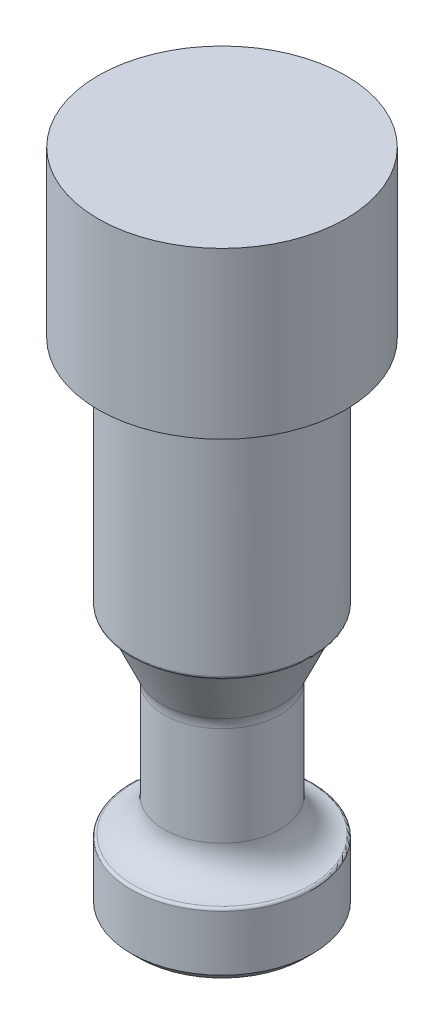
ISO-10303-21;
HEADER;
FILE_DESCRIPTION(('STEP AP214'),'2;1');
FILE_NAME('part.step','',(''),(''),'','','');
FILE_SCHEMA(('AUTOMOTIVE_DESIGN { 1 0 10303 214 1 1 1 1 }'));
ENDSEC;
DATA;
#1=APPLICATION_CONTEXT('core data for automotive mechanical design processes');
#2=APPLICATION_PROTOCOL_DEFINITION('international standard','automotive_design',2000,#1);
#3=PRODUCT_CONTEXT('',#1,'mechanical');
#4=PRODUCT('Part','Part','',(#3));
#5=PRODUCT_RELATED_PRODUCT_CATEGORY('part','',(#4));
#6=PRODUCT_DEFINITION_FORMATION('','',#4);
#7=PRODUCT_DEFINITION_CONTEXT('part definition',#1,'design');
#8=PRODUCT_DEFINITION('design','',#6,#7);
#9=PRODUCT_DEFINITION_SHAPE('','',#8);
#10=(LENGTH_UNIT() NAMED_UNIT(*) SI_UNIT(.MILLI.,.METRE.));
#11=(NAMED_UNIT(*) PLANE_ANGLE_UNIT() SI_UNIT($,.RADIAN.));
#12=(NAMED_UNIT(*) SI_UNIT($,.STERADIAN.) SOLID_ANGLE_UNIT());
#13=UNCERTAINTY_MEASURE_WITH_UNIT(LENGTH_MEASURE(1.E-05),#10,'distance_accuracy_value','');
#14=(GEOMETRIC_REPRESENTATION_CONTEXT(3) GLOBAL_UNCERTAINTY_ASSIGNED_CONTEXT((#13)) GLOBAL_UNIT_ASSIGNED_CONTEXT((#10,
#11,#12)) REPRESENTATION_CONTEXT('',''));
#15=CARTESIAN_POINT('',(0.,0.,0.));
#16=DIRECTION('',(0.,0.,1.));
#17=DIRECTION('',(1.,0.,0.));
#18=AXIS2_PLACEMENT_3D('',#15,#16,#17);
#19=CARTESIAN_POINT('',(0.,47.625,0.));
#20=DIRECTION('',(0.,-1.,0.));
#21=DIRECTION('',(0.,0.,-1.));
#22=AXIS2_PLACEMENT_3D('',#19,#20,#21);
#23=CYLINDRICAL_SURFACE('',#22,8.73125);
#24=CARTESIAN_POINT('',(0.,6.10542113853439,0.));
#25=DIRECTION('',(0.,-1.,0.));
#26=DIRECTION('',(0.,0.,-1.));
#27=AXIS2_PLACEMENT_3D('',#24,#25,#26);
#28=CIRCLE('',#27,8.73125);
#29=CARTESIAN_POINT('',(0.,6.10542113853439,-8.73125));
#30=VERTEX_POINT('',#29);
#31=EDGE_CURVE('E10',#30,#30,#28,.T.);
#32=ORIENTED_EDGE('',*,*,#31,.T.);
#33=EDGE_LOOP('',(#32));
#34=FACE_BOUND('',#33,.T.);
#35=CARTESIAN_POINT('',(0.,0.793750000000003,0.));
#36=DIRECTION('',(0.,1.,0.));
#37=DIRECTION('',(0.,0.,1.));
#38=AXIS2_PLACEMENT_3D('',#35,#36,#37);
#39=CIRCLE('',#38,8.73125);
#40=CARTESIAN_POINT('',(0.,0.793750000000003,8.73125));
#41=VERTEX_POINT('',#40);
#42=EDGE_CURVE('E68',#41,#41,#39,.T.);
#43=ORIENTED_EDGE('',*,*,#42,.T.);
#44=EDGE_LOOP('',(#43));
#45=FACE_BOUND('',#44,.T.);
#46=ADVANCED_FACE('F37',(#34,#45),#23,.T.);
#47=CARTESIAN_POINT('',(0.,0.,0.));
#48=DIRECTION('',(0.,1.,0.));
#49=DIRECTION('',(0.,0.,1.));
#50=AXIS2_PLACEMENT_3D('',#47,#48,#49);
#51=PLANE('',#50);
#52=CARTESIAN_POINT('',(0.,0.,0.));
#53=DIRECTION('',(0.,1.,0.));
#54=DIRECTION('',(0.,0.,1.));
#55=AXIS2_PLACEMENT_3D('',#52,#53,#54);
#56=CIRCLE('',#55,7.9375);
#57=CARTESIAN_POINT('',(0.,0.,7.9375));
#58=VERTEX_POINT('',#57);
#59=EDGE_CURVE('E64',#58,#58,#56,.F.);
#60=ORIENTED_EDGE('',*,*,#59,.T.);
#61=EDGE_LOOP('',(#60));
#62=FACE_BOUND('',#61,.T.);
#63=ADVANCED_FACE('F115',(#62),#51,.F.);
#64=CARTESIAN_POINT('',(0.,0.793750000000003,0.));
#65=DIRECTION('',(0.,1.,0.));
#66=DIRECTION('',(0.,0.,1.));
#67=AXIS2_PLACEMENT_3D('',#64,#65,#66);
#68=CONICAL_SURFACE('',#67,8.73125,0.785398163397448);
#69=CARTESIAN_POINT('',(0.,0.,7.9375));
#70=CARTESIAN_POINT('',(0.,0.008268229166667,7.94576822916666));
#71=CARTESIAN_POINT('',(0.,0.0165364583333336,7.95403645833333));
#72=CARTESIAN_POINT('',(0.,0.0330729166666667,7.97057291666666));
#73=CARTESIAN_POINT('',(0.,0.0413411458333333,7.97884114583333));
#74=CARTESIAN_POINT('',(0.,0.0578776041666666,7.99537760416666));
#75=CARTESIAN_POINT('',(0.,0.0661458333333334,8.00364583333333));
#76=CARTESIAN_POINT('',(0.,0.0826822916666669,8.02018229166666));
#77=CARTESIAN_POINT('',(0.,0.0909505208333338,8.02845052083333));
#78=CARTESIAN_POINT('',(0.,0.107486979166667,8.04498697916666));
#79=CARTESIAN_POINT('',(0.,0.115755208333333,8.05325520833333));
#80=CARTESIAN_POINT('',(0.,0.132291666666667,8.06979166666666));
#81=CARTESIAN_POINT('',(0.,0.140559895833334,8.07805989583333));
#82=CARTESIAN_POINT('',(0.,0.157096354166667,8.09459635416666));
#83=CARTESIAN_POINT('',(0.,0.165364583333334,8.10286458333333));
#84=CARTESIAN_POINT('',(0.,0.181901041666667,8.11940104166666));
#85=CARTESIAN_POINT('',(0.,0.190169270833334,8.12766927083333));
#86=CARTESIAN_POINT('',(0.,0.206705729166667,8.14420572916666));
#87=CARTESIAN_POINT('',(0.,0.214973958333334,8.15247395833333));
#88=CARTESIAN_POINT('',(0.,0.231510416666667,8.16901041666666));
#89=CARTESIAN_POINT('',(0.,0.239778645833334,8.17727864583333));
#90=CARTESIAN_POINT('',(0.,0.256315104166667,8.19381510416667));
#91=CARTESIAN_POINT('',(0.,0.264583333333334,8.20208333333333));
#92=CARTESIAN_POINT('',(0.,0.281119791666668,8.21861979166667));
#93=CARTESIAN_POINT('',(0.,0.289388020833335,8.22688802083333));
#94=CARTESIAN_POINT('',(0.,0.305924479166668,8.24342447916666));
#95=CARTESIAN_POINT('',(0.,0.314192708333334,8.25169270833333));
#96=CARTESIAN_POINT('',(0.,0.330729166666668,8.26822916666666));
#97=CARTESIAN_POINT('',(0.,0.338997395833335,8.27649739583333));
#98=CARTESIAN_POINT('',(0.,0.355533854166668,8.29303385416666));
#99=CARTESIAN_POINT('',(0.,0.363802083333334,8.30130208333333));
#100=CARTESIAN_POINT('',(0.,0.380338541666668,8.31783854166667));
#101=CARTESIAN_POINT('',(0.,0.388606770833335,8.32610677083333));
#102=CARTESIAN_POINT('',(0.,0.405143229166668,8.34264322916667));
#103=CARTESIAN_POINT('',(0.,0.413411458333335,8.35091145833333));
#104=CARTESIAN_POINT('',(0.,0.429947916666668,8.36744791666666));
#105=CARTESIAN_POINT('',(0.,0.438216145833335,8.37571614583333));
#106=CARTESIAN_POINT('',(0.,0.454752604166668,8.39225260416667));
#107=CARTESIAN_POINT('',(0.,0.463020833333335,8.40052083333333));
#108=CARTESIAN_POINT('',(0.,0.479557291666668,8.41705729166667));
#109=CARTESIAN_POINT('',(0.,0.487825520833335,8.42532552083333));
#110=CARTESIAN_POINT('',(0.,0.504361979166668,8.44186197916667));
#111=CARTESIAN_POINT('',(0.,0.512630208333335,8.45013020833333));
#112=CARTESIAN_POINT('',(0.,0.529166666666668,8.46666666666667));
#113=CARTESIAN_POINT('',(0.,0.537434895833335,8.47493489583333));
#114=CARTESIAN_POINT('',(0.,0.553971354166669,8.49147135416666));
#115=CARTESIAN_POINT('',(0.,0.562239583333335,8.49973958333333));
#116=CARTESIAN_POINT('',(0.,0.578776041666668,8.51627604166667));
#117=CARTESIAN_POINT('',(0.,0.587044270833335,8.52454427083333));
#118=CARTESIAN_POINT('',(0.,0.603580729166669,8.54108072916667));
#119=CARTESIAN_POINT('',(0.,0.611848958333336,8.54934895833333));
#120=CARTESIAN_POINT('',(0.,0.628385416666669,8.56588541666667));
#121=CARTESIAN_POINT('',(0.,0.636653645833335,8.57415364583333));
#122=CARTESIAN_POINT('',(0.,0.653190104166669,8.59069010416667));
#123=CARTESIAN_POINT('',(0.,0.661458333333335,8.59895833333333));
#124=CARTESIAN_POINT('',(0.,0.677994791666669,8.61549479166667));
#125=CARTESIAN_POINT('',(0.,0.686263020833336,8.62376302083333));
#126=CARTESIAN_POINT('',(0.,0.702799479166669,8.64029947916667));
#127=CARTESIAN_POINT('',(0.,0.711067708333336,8.64856770833333));
#128=CARTESIAN_POINT('',(0.,0.727604166666669,8.66510416666667));
#129=CARTESIAN_POINT('',(0.,0.735872395833336,8.67337239583333));
#130=CARTESIAN_POINT('',(0.,0.752408854166669,8.68990885416667));
#131=CARTESIAN_POINT('',(0.,0.760677083333336,8.69817708333333));
#132=CARTESIAN_POINT('',(0.,0.777213541666669,8.71471354166667));
#133=CARTESIAN_POINT('',(0.,0.785481770833336,8.72298177083333));
#134=CARTESIAN_POINT('',(0.,0.793750000000003,8.73125));
#135=B_SPLINE_CURVE_WITH_KNOTS('',3,(#69,#70,#71,#72,#73,#74,#75,#76,#77,#78,#79,#80,#81,#82,
#83,#84,#85,#86,#87,#88,#89,#90,#91,#92,#93,#94,#95,#96,#97,#98,#99,#100,#101,#102,#103,#104,
#105,#106,#107,#108,#109,#110,#111,#112,#113,#114,#115,#116,#117,#118,#119,#120,#121,#122,#123,
#124,#125,#126,#127,#128,#129,#130,#131,#132,#133,#134),.UNSPECIFIED.,.F.,.F.,(4,2,2,2,2,2,2,2,
2,2,2,2,2,2,2,2,2,2,2,2,2,2,2,2,2,2,2,2,2,2,2,2,4),(0.,0.035079125472926,0.0701582509458533,
0.105237376418779,0.140316501891705,0.175395627364633,0.210474752837559,0.245553878310486,
0.280633003783412,0.315712129256338,0.350791254729265,0.385870380202191,0.420949505675118,
0.456028631148045,0.491107756620971,0.526186882093898,0.561266007566824,0.59634513303975,
0.631424258512677,0.666503383985603,0.70158250945853,0.736661634931457,0.771740760404383,
0.80681988587731,0.841899011350236,0.876978136823162,0.912057262296089,0.947136387769015,
0.982215513241941,1.01729463871487,1.05237376418779,1.08745288966072,1.12253201513365),.UNSPECIFIED.);
#136=EDGE_CURVE('BSEAM121',#58,#41,#135,.T.);
#137=ORIENTED_EDGE('',*,*,#59,.F.);
#138=ORIENTED_EDGE('',*,*,#42,.F.);
#139=ORIENTED_EDGE('',*,*,#136,.T.);
#140=ORIENTED_EDGE('',*,*,#136,.F.);
#141=EDGE_LOOP('',(#137,#139,#138,#140));
#142=FACE_BOUND('',#141,.T.);
#143=ADVANCED_FACE('F121',(#142),#68,.T.);
#144=CARTESIAN_POINT('',(0.,24.6062507910648,0.));
#145=DIRECTION('',(0.,1.,0.));
#146=DIRECTION('',(0.,0.,1.));
#147=AXIS2_PLACEMENT_3D('',#144,#145,#146);
#148=TOROIDAL_SURFACE('',#147,8.73125,0.793750000000003);
#149=CARTESIAN_POINT('',(0.,25.3763234976499,0.));
#150=DIRECTION('',(0.,-1.,0.));
#151=DIRECTION('',(0.,0.,-1.));
#152=AXIS2_PLACEMENT_3D('',#149,#150,#151);
#153=CIRCLE('',#152,8.53882575757578);
#154=CARTESIAN_POINT('',(0.,25.3763234976499,-8.53882575757578));
#155=VERTEX_POINT('',#154);
#156=EDGE_CURVE('E52',#155,#155,#153,.T.);
#157=ORIENTED_EDGE('',*,*,#156,.T.);
#158=EDGE_LOOP('',(#157));
#159=FACE_BOUND('',#158,.T.);
#160=CARTESIAN_POINT('',(0.,24.9361702795469,0.));
#161=DIRECTION('',(0.,1.,0.));
#162=DIRECTION('',(0.,0.,1.));
#163=AXIS2_PLACEMENT_3D('',#160,#161,#162);
#164=CIRCLE('',#163,8.0093135806252);
#165=CARTESIAN_POINT('',(0.,24.9361702795469,8.0093135806252));
#166=VERTEX_POINT('',#165);
#167=EDGE_CURVE('E85',#166,#166,#164,.T.);
#168=ORIENTED_EDGE('',*,*,#167,.T.);
#169=EDGE_LOOP('',(#168));
#170=FACE_BOUND('',#169,.T.);
#171=ADVANCED_FACE('F153',(#159,#170),#148,.F.);
#172=CARTESIAN_POINT('',(0.,20.0397592565111,0.));
#173=DIRECTION('',(0.,1.,0.));
#174=DIRECTION('',(0.,0.,1.));
#175=AXIS2_PLACEMENT_3D('',#172,#173,#174);
#176=CONICAL_SURFACE('',#175,5.77169074187561,0.428653606815713);
#177=ORIENTED_EDGE('',*,*,#167,.F.);
#178=EDGE_LOOP('',(#177));
#179=FACE_BOUND('',#178,.T.);
#180=CARTESIAN_POINT('',(0.,20.0397592565111,0.));
#181=DIRECTION('',(0.,1.,0.));
#182=DIRECTION('',(0.,0.,1.));
#183=AXIS2_PLACEMENT_3D('',#180,#181,#182);
#184=CIRCLE('',#183,5.77169074187561);
#185=CARTESIAN_POINT('',(0.,20.0397592565111,5.77169074187561));
#186=VERTEX_POINT('',#185);
#187=EDGE_CURVE('E82',#186,#186,#184,.T.);
#188=ORIENTED_EDGE('',*,*,#187,.T.);
#189=EDGE_LOOP('',(#188));
#190=FACE_BOUND('',#189,.T.);
#191=ADVANCED_FACE('F151',(#179,#190),#176,.T.);
#192=CARTESIAN_POINT('',(0.,19.0500007910648,0.));
#193=DIRECTION('',(0.,1.,0.));
#194=DIRECTION('',(0.,0.,1.));
#195=AXIS2_PLACEMENT_3D('',#192,#193,#194);
#196=TOROIDAL_SURFACE('',#195,7.93749999999999,2.38125);
#197=ORIENTED_EDGE('',*,*,#187,.F.);
#198=EDGE_LOOP('',(#197));
#199=FACE_BOUND('',#198,.T.);
#200=CARTESIAN_POINT('',(0.,19.0500007910648,0.));
#201=DIRECTION('',(0.,1.,0.));
#202=DIRECTION('',(0.,0.,1.));
#203=AXIS2_PLACEMENT_3D('',#200,#201,#202);
#204=CIRCLE('',#203,5.55625);
#205=CARTESIAN_POINT('',(0.,19.0500007910648,5.55625));
#206=VERTEX_POINT('',#205);
#207=EDGE_CURVE('E78',#206,#206,#204,.T.);
#208=ORIENTED_EDGE('',*,*,#207,.T.);
#209=EDGE_LOOP('',(#208));
#210=FACE_BOUND('',#209,.T.);
#211=ADVANCED_FACE('F144',(#199,#210),#196,.F.);
#212=CARTESIAN_POINT('',(0.,47.625,0.));
#213=DIRECTION('',(0.,1.,0.));
#214=DIRECTION('',(0.,0.,1.));
#215=AXIS2_PLACEMENT_3D('',#212,#213,#214);
#216=CYLINDRICAL_SURFACE('',#215,5.55625);
#217=CARTESIAN_POINT('',(0.,9.5250007910648,0.));
#218=DIRECTION('',(0.,1.,0.));
#219=DIRECTION('',(0.,0.,1.));
#220=AXIS2_PLACEMENT_3D('',#217,#218,#219);
#221=CIRCLE('',#220,5.55625);
#222=CARTESIAN_POINT('',(0.,9.5250007910648,5.55625));
#223=VERTEX_POINT('',#222);
#224=EDGE_CURVE('E75',#223,#223,#221,.T.);
#225=ORIENTED_EDGE('',*,*,#224,.T.);
#226=EDGE_LOOP('',(#225));
#227=FACE_BOUND('',#226,.T.);
#228=ORIENTED_EDGE('',*,*,#207,.F.);
#229=EDGE_LOOP('',(#228));
#230=FACE_BOUND('',#229,.T.);
#231=ADVANCED_FACE('F135',(#227,#230),#216,.T.);
#232=CARTESIAN_POINT('',(0.,9.52500079106481,0.));
#233=DIRECTION('',(0.,1.,0.));
#234=DIRECTION('',(0.,0.,1.));
#235=AXIS2_PLACEMENT_3D('',#232,#233,#234);
#236=TOROIDAL_SURFACE('',#235,8.73125,3.175);
#237=CARTESIAN_POINT('',(0.,6.35872333501794,0.));
#238=DIRECTION('',(0.,1.,0.));
#239=DIRECTION('',(0.,0.,1.));
#240=AXIS2_PLACEMENT_3D('',#237,#238,#239);
#241=CIRCLE('',#240,8.4960648148148);
#242=CARTESIAN_POINT('',(0.,6.35872333501794,8.4960648148148));
#243=VERTEX_POINT('',#242);
#244=EDGE_CURVE('E45',#243,#243,#241,.T.);
#245=ORIENTED_EDGE('',*,*,#244,.T.);
#246=EDGE_LOOP('',(#245));
#247=FACE_BOUND('',#246,.T.);
#248=ORIENTED_EDGE('',*,*,#224,.F.);
#249=EDGE_LOOP('',(#248));
#250=FACE_BOUND('',#249,.T.);
#251=ADVANCED_FACE('F128',(#247,#250),#236,.F.);
#252=CARTESIAN_POINT('',(0.,25.6227467637573,0.));
#253=DIRECTION('',(0.,-1.,0.));
#254=DIRECTION('',(0.,0.,-1.));
#255=AXIS2_PLACEMENT_3D('',#252,#253,#254);
#256=CIRCLE('',#255,8.73125);
#257=CARTESIAN_POINT('',(0.,25.6227467637573,-8.73125));
#258=VERTEX_POINT('',#257);
#259=EDGE_CURVE('E58',#258,#258,#256,.F.);
#260=ORIENTED_EDGE('',*,*,#259,.T.);
#261=EDGE_LOOP('',(#260));
#262=FACE_BOUND('',#261,.T.);
#263=CARTESIAN_POINT('',(0.,47.625,0.));
#264=DIRECTION('',(0.,1.,0.));
#265=DIRECTION('',(0.,0.,1.));
#266=AXIS2_PLACEMENT_3D('',#263,#264,#265);
#267=CIRCLE('',#266,8.73125);
#268=CARTESIAN_POINT('',(0.,47.625,8.73125));
#269=VERTEX_POINT('',#268);
#270=EDGE_CURVE('E71',#269,#269,#267,.T.);
#271=ORIENTED_EDGE('',*,*,#270,.F.);
#272=EDGE_LOOP('',(#271));
#273=FACE_BOUND('',#272,.T.);
#274=ADVANCED_FACE('F117',(#262,#273),#23,.T.);
#275=CARTESIAN_POINT('',(0.,25.6227467637573,0.));
#276=DIRECTION('',(0.,-1.,0.));
#277=DIRECTION('',(0.,0.,-1.));
#278=AXIS2_PLACEMENT_3D('',#275,#276,#277);
#279=TOROIDAL_SURFACE('',#278,8.47725,0.254);
#280=ORIENTED_EDGE('',*,*,#156,.F.);
#281=EDGE_LOOP('',(#280));
#282=FACE_BOUND('',#281,.T.);
#283=ORIENTED_EDGE('',*,*,#259,.F.);
#284=EDGE_LOOP('',(#283));
#285=FACE_BOUND('',#284,.T.);
#286=ADVANCED_FACE('F127',(#282,#285),#279,.T.);
#287=CARTESIAN_POINT('',(0.,6.10542113853439,0.));
#288=DIRECTION('',(0.,-1.,0.));
#289=DIRECTION('',(0.,0.,-1.));
#290=AXIS2_PLACEMENT_3D('',#287,#288,#289);
#291=TOROIDAL_SURFACE('',#290,8.47725,0.254);
#292=ORIENTED_EDGE('',*,*,#31,.F.);
#293=EDGE_LOOP('',(#292));
#294=FACE_BOUND('',#293,.T.);
#295=ORIENTED_EDGE('',*,*,#244,.F.);
#296=EDGE_LOOP('',(#295));
#297=FACE_BOUND('',#296,.T.);
#298=ADVANCED_FACE('F39',(#294,#297),#291,.T.);
#299=CARTESIAN_POINT('',(0.,63.5,0.));
#300=DIRECTION('',(0.,-1.,0.));
#301=DIRECTION('',(0.,0.,-1.));
#302=AXIS2_PLACEMENT_3D('',#299,#300,#301);
#303=CYLINDRICAL_SURFACE('',#302,11.90625);
#304=CARTESIAN_POINT('',(0.,63.5,0.));
#305=DIRECTION('',(0.,1.,0.));
#306=DIRECTION('',(0.,0.,1.));
#307=AXIS2_PLACEMENT_3D('',#304,#305,#306);
#308=CIRCLE('',#307,11.90625);
#309=CARTESIAN_POINT('',(0.,63.5,11.90625));
#310=VERTEX_POINT('',#309);
#311=EDGE_CURVE('E89',#310,#310,#308,.T.);
#312=ORIENTED_EDGE('',*,*,#311,.F.);
#313=EDGE_LOOP('',(#312));
#314=FACE_BOUND('',#313,.T.);
#315=CARTESIAN_POINT('',(0.,47.625,0.));
#316=DIRECTION('',(0.,1.,0.));
#317=DIRECTION('',(0.,0.,1.));
#318=AXIS2_PLACEMENT_3D('',#315,#316,#317);
#319=CIRCLE('',#318,11.90625);
#320=CARTESIAN_POINT('',(0.,47.625,11.90625));
#321=VERTEX_POINT('',#320);
#322=EDGE_CURVE('E90',#321,#321,#319,.T.);
#323=ORIENTED_EDGE('',*,*,#322,.T.);
#324=EDGE_LOOP('',(#323));
#325=FACE_BOUND('',#324,.T.);
#326=ADVANCED_FACE('F100',(#314,#325),#303,.T.);
#327=CARTESIAN_POINT('',(0.,63.5,0.));
#328=DIRECTION('',(0.,1.,0.));
#329=DIRECTION('',(0.,0.,1.));
#330=AXIS2_PLACEMENT_3D('',#327,#328,#329);
#331=PLANE('',#330);
#332=ORIENTED_EDGE('',*,*,#311,.T.);
#333=EDGE_LOOP('',(#332));
#334=FACE_BOUND('',#333,.T.);
#335=ADVANCED_FACE('F98',(#334),#331,.T.);
#336=CARTESIAN_POINT('',(0.,47.625,0.));
#337=DIRECTION('',(0.,1.,0.));
#338=DIRECTION('',(0.,0.,1.));
#339=AXIS2_PLACEMENT_3D('',#336,#337,#338);
#340=PLANE('',#339);
#341=ORIENTED_EDGE('',*,*,#270,.T.);
#342=EDGE_LOOP('',(#341));
#343=FACE_BOUND('',#342,.T.);
#344=ORIENTED_EDGE('',*,*,#322,.F.);
#345=EDGE_LOOP('',(#344));
#346=FACE_BOUND('',#345,.T.);
#347=ADVANCED_FACE('F106',(#343,#346),#340,.F.);
#348=CLOSED_SHELL('',(#46,#63,#143,#171,#191,#211,#231,#251,#274,#286,#298,#326,#335,#347));
#349=MANIFOLD_SOLID_BREP('B2',#348);
#350=ADVANCED_BREP_SHAPE_REPRESENTATION('',(#18,#349),#14);
#351=SHAPE_DEFINITION_REPRESENTATION(#9,#350);
ENDSEC;
END-ISO-10303-21;
